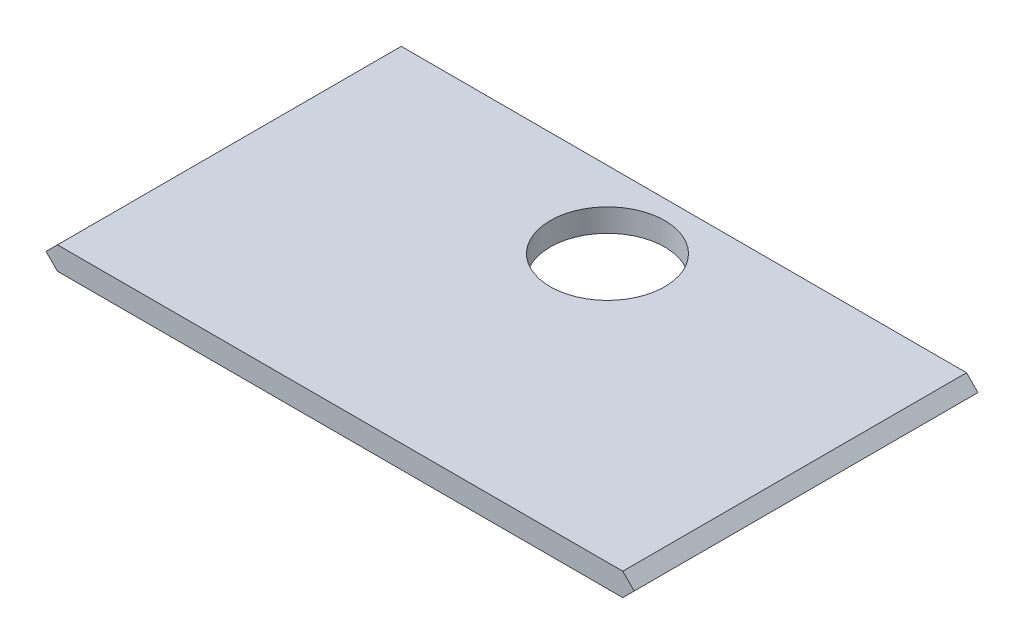
ISO-10303-21;
HEADER;
FILE_DESCRIPTION(('STEP AP214'),'2;1');
FILE_NAME('part.step','',(''),(''),'','','');
FILE_SCHEMA(('AUTOMOTIVE_DESIGN { 1 0 10303 214 1 1 1 1 }'));
ENDSEC;
DATA;
#1=APPLICATION_CONTEXT('core data for automotive mechanical design processes');
#2=APPLICATION_PROTOCOL_DEFINITION('international standard','automotive_design',2000,#1);
#3=PRODUCT_CONTEXT('',#1,'mechanical');
#4=PRODUCT('Part','Part','',(#3));
#5=PRODUCT_RELATED_PRODUCT_CATEGORY('part','',(#4));
#6=PRODUCT_DEFINITION_FORMATION('','',#4);
#7=PRODUCT_DEFINITION_CONTEXT('part definition',#1,'design');
#8=PRODUCT_DEFINITION('design','',#6,#7);
#9=PRODUCT_DEFINITION_SHAPE('','',#8);
#10=(LENGTH_UNIT() NAMED_UNIT(*) SI_UNIT(.MILLI.,.METRE.));
#11=(NAMED_UNIT(*) PLANE_ANGLE_UNIT() SI_UNIT($,.RADIAN.));
#12=(NAMED_UNIT(*) SI_UNIT($,.STERADIAN.) SOLID_ANGLE_UNIT());
#13=UNCERTAINTY_MEASURE_WITH_UNIT(LENGTH_MEASURE(1.E-05),#10,'distance_accuracy_value','');
#14=(GEOMETRIC_REPRESENTATION_CONTEXT(3) GLOBAL_UNCERTAINTY_ASSIGNED_CONTEXT((#13)) GLOBAL_UNIT_ASSIGNED_CONTEXT((#10,
#11,#12)) REPRESENTATION_CONTEXT('',''));
#15=CARTESIAN_POINT('',(0.,0.,0.));
#16=DIRECTION('',(0.,0.,1.));
#17=DIRECTION('',(1.,0.,0.));
#18=AXIS2_PLACEMENT_3D('',#15,#16,#17);
#19=CARTESIAN_POINT('',(-1.5,1.50000000000001,45.));
#20=DIRECTION('',(0.707106781186549,0.707106781186546,0.));
#21=DIRECTION('',(-0.707106781186546,0.707106781186549,0.));
#22=AXIS2_PLACEMENT_3D('',#19,#20,#21);
#23=PLANE('',#22);
#24=DIRECTION('',(0.707106781186546,-0.707106781186549,0.));
#25=VECTOR('',#24,1.);
#26=CARTESIAN_POINT('',(-1.5,1.50000000000001,0.));
#27=LINE('',#26,#25);
#28=CARTESIAN_POINT('',(-1.5,1.50000000000001,0.));
#29=VERTEX_POINT('',#28);
#30=CARTESIAN_POINT('',(0.,0.,0.));
#31=VERTEX_POINT('',#30);
#32=EDGE_CURVE('E117',#29,#31,#27,.T.);
#33=ORIENTED_EDGE('',*,*,#32,.T.);
#34=DIRECTION('',(0.,0.,-1.));
#35=VECTOR('',#34,1.);
#36=CARTESIAN_POINT('',(0.,0.,45.));
#37=LINE('',#36,#35);
#38=CARTESIAN_POINT('',(0.,0.,45.));
#39=VERTEX_POINT('',#38);
#40=EDGE_CURVE('E11',#39,#31,#37,.T.);
#41=ORIENTED_EDGE('',*,*,#40,.F.);
#42=DIRECTION('',(0.707106781186546,-0.707106781186549,0.));
#43=VECTOR('',#42,1.);
#44=CARTESIAN_POINT('',(-1.5,1.50000000000001,45.));
#45=LINE('',#44,#43);
#46=CARTESIAN_POINT('',(-1.5,1.50000000000001,45.));
#47=VERTEX_POINT('',#46);
#48=EDGE_CURVE('E128',#47,#39,#45,.T.);
#49=ORIENTED_EDGE('',*,*,#48,.F.);
#50=DIRECTION('',(0.,0.,-1.));
#51=VECTOR('',#50,1.);
#52=CARTESIAN_POINT('',(-1.5,1.50000000000001,45.));
#53=LINE('',#52,#51);
#54=EDGE_CURVE('E113',#47,#29,#53,.T.);
#55=ORIENTED_EDGE('',*,*,#54,.T.);
#56=EDGE_LOOP('',(#33,#41,#49,#55));
#57=FACE_BOUND('',#56,.T.);
#58=ADVANCED_FACE('F33',(#57),#23,.F.);
#59=CARTESIAN_POINT('',(0.,0.,45.));
#60=DIRECTION('',(0.,1.,0.));
#61=DIRECTION('',(0.,0.,1.));
#62=AXIS2_PLACEMENT_3D('',#59,#60,#61);
#63=PLANE('',#62);
#64=CARTESIAN_POINT('',(37.,0.,10.));
#65=DIRECTION('',(0.,1.,0.));
#66=DIRECTION('',(-1.,0.,0.));
#67=AXIS2_PLACEMENT_3D('',#64,#65,#66);
#68=CIRCLE('',#67,7.5);
#69=CARTESIAN_POINT('',(29.5,0.,10.));
#70=VERTEX_POINT('',#69);
#71=EDGE_CURVE('E121',#70,#70,#68,.T.);
#72=ORIENTED_EDGE('',*,*,#71,.T.);
#73=EDGE_LOOP('',(#72));
#74=FACE_BOUND('',#73,.T.);
#75=DIRECTION('',(1.,0.,0.));
#76=VECTOR('',#75,1.);
#77=CARTESIAN_POINT('',(0.,0.,0.));
#78=LINE('',#77,#76);
#79=CARTESIAN_POINT('',(74.,0.,0.));
#80=VERTEX_POINT('',#79);
#81=EDGE_CURVE('E120',#31,#80,#78,.T.);
#82=ORIENTED_EDGE('',*,*,#81,.T.);
#83=DIRECTION('',(0.,0.,-1.));
#84=VECTOR('',#83,1.);
#85=CARTESIAN_POINT('',(74.,0.,45.));
#86=LINE('',#85,#84);
#87=CARTESIAN_POINT('',(74.,0.,45.));
#88=VERTEX_POINT('',#87);
#89=EDGE_CURVE('E41',#88,#80,#86,.T.);
#90=ORIENTED_EDGE('',*,*,#89,.F.);
#91=DIRECTION('',(1.,0.,0.));
#92=VECTOR('',#91,1.);
#93=CARTESIAN_POINT('',(0.,0.,45.));
#94=LINE('',#93,#92);
#95=EDGE_CURVE('E86',#39,#88,#94,.T.);
#96=ORIENTED_EDGE('',*,*,#95,.F.);
#97=ORIENTED_EDGE('',*,*,#40,.T.);
#98=EDGE_LOOP('',(#82,#90,#96,#97));
#99=FACE_BOUND('',#98,.T.);
#100=ADVANCED_FACE('F153',(#74,#99),#63,.F.);
#101=CARTESIAN_POINT('',(74.,0.,45.));
#102=DIRECTION('',(-0.707106781186543,0.707106781186552,0.));
#103=DIRECTION('',(-0.707106781186552,-0.707106781186543,0.));
#104=AXIS2_PLACEMENT_3D('',#101,#102,#103);
#105=PLANE('',#104);
#106=DIRECTION('',(0.707106781186552,0.707106781186543,0.));
#107=VECTOR('',#106,1.);
#108=CARTESIAN_POINT('',(74.,0.,0.));
#109=LINE('',#108,#107);
#110=CARTESIAN_POINT('',(75.5,1.50000000000001,0.));
#111=VERTEX_POINT('',#110);
#112=EDGE_CURVE('E123',#80,#111,#109,.T.);
#113=ORIENTED_EDGE('',*,*,#112,.T.);
#114=DIRECTION('',(0.,0.,-1.));
#115=VECTOR('',#114,1.);
#116=CARTESIAN_POINT('',(75.5,1.50000000000001,45.));
#117=LINE('',#116,#115);
#118=CARTESIAN_POINT('',(75.5,1.50000000000001,45.));
#119=VERTEX_POINT('',#118);
#120=EDGE_CURVE('E108',#119,#111,#117,.T.);
#121=ORIENTED_EDGE('',*,*,#120,.F.);
#122=DIRECTION('',(0.707106781186552,0.707106781186543,0.));
#123=VECTOR('',#122,1.);
#124=CARTESIAN_POINT('',(74.,0.,45.));
#125=LINE('',#124,#123);
#126=EDGE_CURVE('E99',#88,#119,#125,.T.);
#127=ORIENTED_EDGE('',*,*,#126,.F.);
#128=ORIENTED_EDGE('',*,*,#89,.T.);
#129=EDGE_LOOP('',(#113,#121,#127,#128));
#130=FACE_BOUND('',#129,.T.);
#131=ADVANCED_FACE('F134',(#130),#105,.F.);
#132=CARTESIAN_POINT('',(75.5,1.50000000000001,45.));
#133=DIRECTION('',(-0.707106781186537,-0.707106781186558,0.));
#134=DIRECTION('',(0.707106781186558,-0.707106781186537,0.));
#135=AXIS2_PLACEMENT_3D('',#132,#133,#134);
#136=PLANE('',#135);
#137=DIRECTION('',(-0.707106781186558,0.707106781186537,0.));
#138=VECTOR('',#137,1.);
#139=CARTESIAN_POINT('',(75.5,1.50000000000001,0.));
#140=LINE('',#139,#138);
#141=CARTESIAN_POINT('',(74.,3.,0.));
#142=VERTEX_POINT('',#141);
#143=EDGE_CURVE('E107',#111,#142,#140,.T.);
#144=ORIENTED_EDGE('',*,*,#143,.T.);
#145=DIRECTION('',(0.,0.,-1.));
#146=VECTOR('',#145,1.);
#147=CARTESIAN_POINT('',(74.,3.,45.));
#148=LINE('',#147,#146);
#149=CARTESIAN_POINT('',(74.,3.,45.));
#150=VERTEX_POINT('',#149);
#151=EDGE_CURVE('E104',#150,#142,#148,.T.);
#152=ORIENTED_EDGE('',*,*,#151,.F.);
#153=DIRECTION('',(-0.707106781186558,0.707106781186537,0.));
#154=VECTOR('',#153,1.);
#155=CARTESIAN_POINT('',(75.5,1.50000000000001,45.));
#156=LINE('',#155,#154);
#157=EDGE_CURVE('E93',#119,#150,#156,.T.);
#158=ORIENTED_EDGE('',*,*,#157,.F.);
#159=ORIENTED_EDGE('',*,*,#120,.T.);
#160=EDGE_LOOP('',(#144,#152,#158,#159));
#161=FACE_BOUND('',#160,.T.);
#162=ADVANCED_FACE('F105',(#161),#136,.F.);
#163=CARTESIAN_POINT('',(74.,3.,45.));
#164=DIRECTION('',(0.,-1.,0.));
#165=DIRECTION('',(1.,0.,0.));
#166=AXIS2_PLACEMENT_3D('',#163,#164,#165);
#167=PLANE('',#166);
#168=CARTESIAN_POINT('',(37.,2.99999999999999,10.));
#169=DIRECTION('',(0.,1.,0.));
#170=DIRECTION('',(-1.,0.,0.));
#171=AXIS2_PLACEMENT_3D('',#168,#169,#170);
#172=CIRCLE('',#171,7.5);
#173=CARTESIAN_POINT('',(29.5,2.99999999999999,10.));
#174=VERTEX_POINT('',#173);
#175=EDGE_CURVE('E210',#174,#174,#172,.T.);
#176=ORIENTED_EDGE('',*,*,#175,.F.);
#177=EDGE_LOOP('',(#176));
#178=FACE_BOUND('',#177,.T.);
#179=DIRECTION('',(-1.,0.,0.));
#180=VECTOR('',#179,1.);
#181=CARTESIAN_POINT('',(74.,3.,0.));
#182=LINE('',#181,#180);
#183=CARTESIAN_POINT('',(0.,2.99999999999999,0.));
#184=VERTEX_POINT('',#183);
#185=EDGE_CURVE('E72',#142,#184,#182,.T.);
#186=ORIENTED_EDGE('',*,*,#185,.T.);
#187=DIRECTION('',(0.,0.,-1.));
#188=VECTOR('',#187,1.);
#189=CARTESIAN_POINT('',(0.,2.99999999999999,45.));
#190=LINE('',#189,#188);
#191=CARTESIAN_POINT('',(0.,2.99999999999999,45.));
#192=VERTEX_POINT('',#191);
#193=EDGE_CURVE('E109',#192,#184,#190,.T.);
#194=ORIENTED_EDGE('',*,*,#193,.F.);
#195=DIRECTION('',(-1.,0.,0.));
#196=VECTOR('',#195,1.);
#197=CARTESIAN_POINT('',(74.,3.,45.));
#198=LINE('',#197,#196);
#199=EDGE_CURVE('E97',#150,#192,#198,.T.);
#200=ORIENTED_EDGE('',*,*,#199,.F.);
#201=ORIENTED_EDGE('',*,*,#151,.T.);
#202=EDGE_LOOP('',(#186,#194,#200,#201));
#203=FACE_BOUND('',#202,.T.);
#204=ADVANCED_FACE('F111',(#178,#203),#167,.F.);
#205=CARTESIAN_POINT('',(0.,2.99999999999999,45.));
#206=DIRECTION('',(0.707106781186543,-0.707106781186552,0.));
#207=DIRECTION('',(0.707106781186552,0.707106781186543,0.));
#208=AXIS2_PLACEMENT_3D('',#205,#206,#207);
#209=PLANE('',#208);
#210=DIRECTION('',(-0.707106781186552,-0.707106781186543,0.));
#211=VECTOR('',#210,1.);
#212=CARTESIAN_POINT('',(0.,2.99999999999999,0.));
#213=LINE('',#212,#211);
#214=EDGE_CURVE('E78',#184,#29,#213,.T.);
#215=ORIENTED_EDGE('',*,*,#214,.T.);
#216=ORIENTED_EDGE('',*,*,#54,.F.);
#217=DIRECTION('',(-0.707106781186552,-0.707106781186543,0.));
#218=VECTOR('',#217,1.);
#219=CARTESIAN_POINT('',(0.,2.99999999999999,45.));
#220=LINE('',#219,#218);
#221=EDGE_CURVE('E49',#192,#47,#220,.T.);
#222=ORIENTED_EDGE('',*,*,#221,.F.);
#223=ORIENTED_EDGE('',*,*,#193,.T.);
#224=EDGE_LOOP('',(#215,#216,#222,#223));
#225=FACE_BOUND('',#224,.T.);
#226=ADVANCED_FACE('F141',(#225),#209,.F.);
#227=CARTESIAN_POINT('',(0.,0.,45.));
#228=DIRECTION('',(0.,0.,1.));
#229=DIRECTION('',(1.,0.,0.));
#230=AXIS2_PLACEMENT_3D('',#227,#228,#229);
#231=PLANE('',#230);
#232=ORIENTED_EDGE('',*,*,#48,.T.);
#233=ORIENTED_EDGE('',*,*,#95,.T.);
#234=ORIENTED_EDGE('',*,*,#126,.T.);
#235=ORIENTED_EDGE('',*,*,#157,.T.);
#236=ORIENTED_EDGE('',*,*,#199,.T.);
#237=ORIENTED_EDGE('',*,*,#221,.T.);
#238=EDGE_LOOP('',(#232,#233,#234,#235,#236,#237));
#239=FACE_BOUND('',#238,.T.);
#240=ADVANCED_FACE('F95',(#239),#231,.T.);
#241=CARTESIAN_POINT('',(0.,0.,0.));
#242=DIRECTION('',(0.,0.,1.));
#243=DIRECTION('',(1.,0.,0.));
#244=AXIS2_PLACEMENT_3D('',#241,#242,#243);
#245=PLANE('',#244);
#246=ORIENTED_EDGE('',*,*,#32,.F.);
#247=ORIENTED_EDGE('',*,*,#214,.F.);
#248=ORIENTED_EDGE('',*,*,#185,.F.);
#249=ORIENTED_EDGE('',*,*,#143,.F.);
#250=ORIENTED_EDGE('',*,*,#112,.F.);
#251=ORIENTED_EDGE('',*,*,#81,.F.);
#252=EDGE_LOOP('',(#246,#247,#248,#249,#250,#251));
#253=FACE_BOUND('',#252,.T.);
#254=ADVANCED_FACE('F137',(#253),#245,.F.);
#255=CARTESIAN_POINT('',(37.,0.,10.));
#256=DIRECTION('',(0.,1.,0.));
#257=DIRECTION('',(-1.,0.,0.));
#258=AXIS2_PLACEMENT_3D('',#255,#256,#257);
#259=CYLINDRICAL_SURFACE('',#258,7.5);
#260=ORIENTED_EDGE('',*,*,#71,.F.);
#261=EDGE_LOOP('',(#260));
#262=FACE_BOUND('',#261,.T.);
#263=ORIENTED_EDGE('',*,*,#175,.T.);
#264=EDGE_LOOP('',(#263));
#265=FACE_BOUND('',#264,.T.);
#266=ADVANCED_FACE('F182',(#262,#265),#259,.F.);
#267=CLOSED_SHELL('',(#58,#100,#131,#162,#204,#226,#240,#254,#266));
#268=MANIFOLD_SOLID_BREP('B2',#267);
#269=ADVANCED_BREP_SHAPE_REPRESENTATION('',(#18,#268),#14);
#270=SHAPE_DEFINITION_REPRESENTATION(#9,#269);
ENDSEC;
END-ISO-10303-21;
